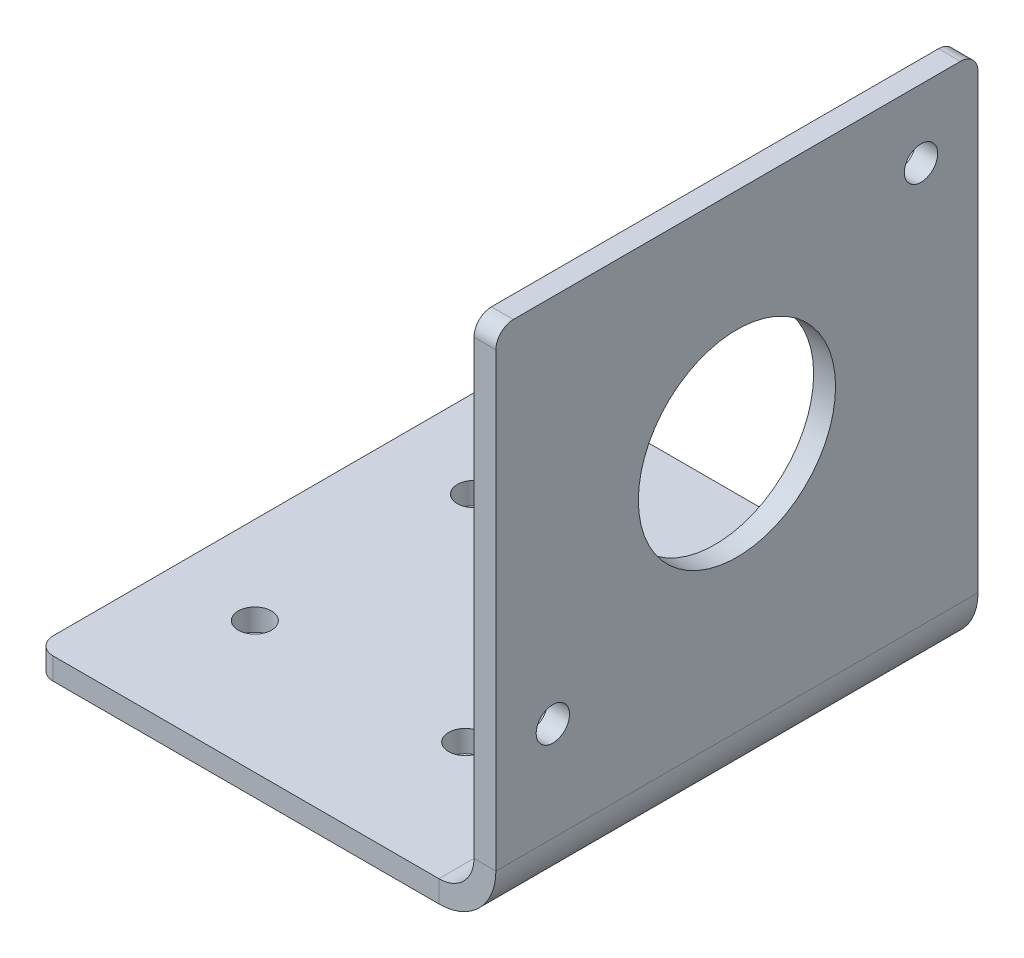
ISO-10303-21;
HEADER;
FILE_DESCRIPTION(('STEP AP214'),'2;1');
FILE_NAME('part.step','',(''),(''),'','','');
FILE_SCHEMA(('AUTOMOTIVE_DESIGN { 1 0 10303 214 1 1 1 1 }'));
ENDSEC;
DATA;
#1=APPLICATION_CONTEXT('core data for automotive mechanical design processes');
#2=APPLICATION_PROTOCOL_DEFINITION('international standard','automotive_design',2000,#1);
#3=PRODUCT_CONTEXT('',#1,'mechanical');
#4=PRODUCT('Part','Part','',(#3));
#5=PRODUCT_RELATED_PRODUCT_CATEGORY('part','',(#4));
#6=PRODUCT_DEFINITION_FORMATION('','',#4);
#7=PRODUCT_DEFINITION_CONTEXT('part definition',#1,'design');
#8=PRODUCT_DEFINITION('design','',#6,#7);
#9=PRODUCT_DEFINITION_SHAPE('','',#8);
#10=(LENGTH_UNIT() NAMED_UNIT(*) SI_UNIT(.MILLI.,.METRE.));
#11=(NAMED_UNIT(*) PLANE_ANGLE_UNIT() SI_UNIT($,.RADIAN.));
#12=(NAMED_UNIT(*) SI_UNIT($,.STERADIAN.) SOLID_ANGLE_UNIT());
#13=UNCERTAINTY_MEASURE_WITH_UNIT(LENGTH_MEASURE(1.E-05),#10,'distance_accuracy_value','');
#14=(GEOMETRIC_REPRESENTATION_CONTEXT(3) GLOBAL_UNCERTAINTY_ASSIGNED_CONTEXT((#13)) GLOBAL_UNIT_ASSIGNED_CONTEXT((#10,
#11,#12)) REPRESENTATION_CONTEXT('',''));
#15=CARTESIAN_POINT('',(0.,0.,0.));
#16=DIRECTION('',(0.,0.,1.));
#17=DIRECTION('',(1.,0.,0.));
#18=AXIS2_PLACEMENT_3D('',#15,#16,#17);
#19=CARTESIAN_POINT('',(-63.5,-34.925,-34.925));
#20=DIRECTION('',(0.,0.,-1.));
#21=DIRECTION('',(1.,0.,0.));
#22=AXIS2_PLACEMENT_3D('',#19,#20,#21);
#23=PLANE('',#22);
#24=DIRECTION('',(1.,0.,0.));
#25=VECTOR('',#24,1.);
#26=CARTESIAN_POINT('',(-63.5,-38.1,-34.925));
#27=LINE('',#26,#25);
#28=CARTESIAN_POINT('',(-60.96,-38.1,-34.925));
#29=VERTEX_POINT('',#28);
#30=CARTESIAN_POINT('',(-5.08,-38.1,-34.925));
#31=VERTEX_POINT('',#30);
#32=EDGE_CURVE('E192',#29,#31,#27,.T.);
#33=ORIENTED_EDGE('',*,*,#32,.F.);
#34=DIRECTION('',(0.,1.,0.));
#35=VECTOR('',#34,1.);
#36=CARTESIAN_POINT('',(-60.96,-34.925,-34.925));
#37=LINE('',#36,#35);
#38=CARTESIAN_POINT('',(-60.96,-34.925,-34.925));
#39=VERTEX_POINT('',#38);
#40=EDGE_CURVE('E135',#29,#39,#37,.T.);
#41=ORIENTED_EDGE('',*,*,#40,.T.);
#42=DIRECTION('',(1.,0.,0.));
#43=VECTOR('',#42,1.);
#44=CARTESIAN_POINT('',(-63.5,-34.925,-34.925));
#45=LINE('',#44,#43);
#46=CARTESIAN_POINT('',(-5.08,-34.925,-34.925));
#47=VERTEX_POINT('',#46);
#48=EDGE_CURVE('E129',#39,#47,#45,.T.);
#49=ORIENTED_EDGE('',*,*,#48,.T.);
#50=DIRECTION('',(0.,1.,0.));
#51=VECTOR('',#50,1.);
#52=CARTESIAN_POINT('',(-5.08,-34.925,-34.925));
#53=LINE('',#52,#51);
#54=EDGE_CURVE('E132',#31,#47,#53,.T.);
#55=ORIENTED_EDGE('',*,*,#54,.F.);
#56=EDGE_LOOP('',(#33,#41,#49,#55));
#57=FACE_BOUND('',#56,.T.);
#58=ADVANCED_FACE('F36',(#57),#23,.T.);
#59=CARTESIAN_POINT('',(-63.5,-34.925,-34.925));
#60=DIRECTION('',(-1.,0.,0.));
#61=DIRECTION('',(0.,0.,-1.));
#62=AXIS2_PLACEMENT_3D('',#59,#60,#61);
#63=PLANE('',#62);
#64=DIRECTION('',(0.,0.,-1.));
#65=VECTOR('',#64,1.);
#66=CARTESIAN_POINT('',(-63.5,-34.925,-34.925));
#67=LINE('',#66,#65);
#68=CARTESIAN_POINT('',(-63.5,-34.925,32.385));
#69=VERTEX_POINT('',#68);
#70=CARTESIAN_POINT('',(-63.5,-34.925,-32.385));
#71=VERTEX_POINT('',#70);
#72=EDGE_CURVE('E138',#69,#71,#67,.T.);
#73=ORIENTED_EDGE('',*,*,#72,.T.);
#74=DIRECTION('',(0.,1.,0.));
#75=VECTOR('',#74,1.);
#76=CARTESIAN_POINT('',(-63.5,-34.925,-32.385));
#77=LINE('',#76,#75);
#78=CARTESIAN_POINT('',(-63.5,-38.1,-32.385));
#79=VERTEX_POINT('',#78);
#80=EDGE_CURVE('E220',#71,#79,#77,.F.);
#81=ORIENTED_EDGE('',*,*,#80,.T.);
#82=DIRECTION('',(0.,0.,-1.));
#83=VECTOR('',#82,1.);
#84=CARTESIAN_POINT('',(-63.5,-38.1,-34.925));
#85=LINE('',#84,#83);
#86=CARTESIAN_POINT('',(-63.5,-38.1,32.385));
#87=VERTEX_POINT('',#86);
#88=EDGE_CURVE('E194',#87,#79,#85,.T.);
#89=ORIENTED_EDGE('',*,*,#88,.F.);
#90=DIRECTION('',(0.,-1.,0.));
#91=VECTOR('',#90,1.);
#92=CARTESIAN_POINT('',(-63.5,-34.925,32.385));
#93=LINE('',#92,#91);
#94=EDGE_CURVE('E217',#87,#69,#93,.F.);
#95=ORIENTED_EDGE('',*,*,#94,.T.);
#96=EDGE_LOOP('',(#73,#81,#89,#95));
#97=FACE_BOUND('',#96,.T.);
#98=ADVANCED_FACE('F293',(#97),#63,.T.);
#99=CARTESIAN_POINT('',(-63.5,-34.925,34.925));
#100=DIRECTION('',(0.,0.,-1.));
#101=DIRECTION('',(1.,0.,0.));
#102=AXIS2_PLACEMENT_3D('',#99,#100,#101);
#103=PLANE('',#102);
#104=DIRECTION('',(1.,0.,0.));
#105=VECTOR('',#104,1.);
#106=CARTESIAN_POINT('',(-63.5,-34.925,34.925));
#107=LINE('',#106,#105);
#108=CARTESIAN_POINT('',(-60.96,-34.925,34.925));
#109=VERTEX_POINT('',#108);
#110=CARTESIAN_POINT('',(-5.08,-34.925,34.925));
#111=VERTEX_POINT('',#110);
#112=EDGE_CURVE('E164',#109,#111,#107,.T.);
#113=ORIENTED_EDGE('',*,*,#112,.F.);
#114=DIRECTION('',(0.,1.,0.));
#115=VECTOR('',#114,1.);
#116=CARTESIAN_POINT('',(-60.96,-34.925,34.925));
#117=LINE('',#116,#115);
#118=CARTESIAN_POINT('',(-60.96,-38.1,34.925));
#119=VERTEX_POINT('',#118);
#120=EDGE_CURVE('E226',#109,#119,#117,.F.);
#121=ORIENTED_EDGE('',*,*,#120,.T.);
#122=DIRECTION('',(1.,0.,0.));
#123=VECTOR('',#122,1.);
#124=CARTESIAN_POINT('',(-63.5,-38.1,34.925));
#125=LINE('',#124,#123);
#126=CARTESIAN_POINT('',(-5.08,-38.1,34.925));
#127=VERTEX_POINT('',#126);
#128=EDGE_CURVE('E188',#119,#127,#125,.T.);
#129=ORIENTED_EDGE('',*,*,#128,.T.);
#130=DIRECTION('',(0.,1.,0.));
#131=VECTOR('',#130,1.);
#132=CARTESIAN_POINT('',(-5.08,-34.925,34.925));
#133=LINE('',#132,#131);
#134=EDGE_CURVE('E150',#127,#111,#133,.T.);
#135=ORIENTED_EDGE('',*,*,#134,.T.);
#136=EDGE_LOOP('',(#113,#121,#129,#135));
#137=FACE_BOUND('',#136,.T.);
#138=ADVANCED_FACE('F298',(#137),#103,.F.);
#139=CARTESIAN_POINT('',(-5.08,-29.845,34.925));
#140=DIRECTION('',(0.,0.,-1.));
#141=DIRECTION('',(-1.,0.,0.));
#142=AXIS2_PLACEMENT_3D('',#139,#140,#141);
#143=PLANE('',#142);
#144=ORIENTED_EDGE('',*,*,#134,.F.);
#145=CARTESIAN_POINT('',(-5.08,-29.845,34.925));
#146=DIRECTION('',(0.,0.,-1.));
#147=DIRECTION('',(-1.,0.,0.));
#148=AXIS2_PLACEMENT_3D('',#145,#146,#147);
#149=CIRCLE('',#148,8.255);
#150=CARTESIAN_POINT('',(3.175,-29.845,34.925));
#151=VERTEX_POINT('',#150);
#152=EDGE_CURVE('E189',#127,#151,#149,.F.);
#153=ORIENTED_EDGE('',*,*,#152,.T.);
#154=DIRECTION('',(-1.,0.,0.));
#155=VECTOR('',#154,1.);
#156=CARTESIAN_POINT('',(0.,-29.845,34.925));
#157=LINE('',#156,#155);
#158=CARTESIAN_POINT('',(0.,-29.845,34.925));
#159=VERTEX_POINT('',#158);
#160=EDGE_CURVE('E207',#151,#159,#157,.T.);
#161=ORIENTED_EDGE('',*,*,#160,.T.);
#162=CARTESIAN_POINT('',(-5.08,-29.845,34.925));
#163=DIRECTION('',(0.,0.,1.));
#164=DIRECTION('',(1.,0.,0.));
#165=AXIS2_PLACEMENT_3D('',#162,#163,#164);
#166=CIRCLE('',#165,5.08);
#167=EDGE_CURVE('E139',#111,#159,#166,.T.);
#168=ORIENTED_EDGE('',*,*,#167,.F.);
#169=EDGE_LOOP('',(#144,#153,#161,#168));
#170=FACE_BOUND('',#169,.T.);
#171=ADVANCED_FACE('F375',(#170),#143,.F.);
#172=CARTESIAN_POINT('',(0.,-38.1,34.925));
#173=DIRECTION('',(0.,0.,-1.));
#174=DIRECTION('',(0.,-1.,0.));
#175=AXIS2_PLACEMENT_3D('',#172,#173,#174);
#176=PLANE('',#175);
#177=DIRECTION('',(0.,1.,0.));
#178=VECTOR('',#177,1.);
#179=CARTESIAN_POINT('',(3.175,0.,34.925));
#180=LINE('',#179,#178);
#181=CARTESIAN_POINT('',(3.175,35.56,34.925));
#182=VERTEX_POINT('',#181);
#183=EDGE_CURVE('E186',#182,#151,#180,.F.);
#184=ORIENTED_EDGE('',*,*,#183,.F.);
#185=DIRECTION('',(1.,0.,0.));
#186=VECTOR('',#185,1.);
#187=CARTESIAN_POINT('',(0.,35.56,34.925));
#188=LINE('',#187,#186);
#189=CARTESIAN_POINT('',(0.,35.56,34.925));
#190=VERTEX_POINT('',#189);
#191=EDGE_CURVE('E11',#182,#190,#188,.F.);
#192=ORIENTED_EDGE('',*,*,#191,.T.);
#193=DIRECTION('',(0.,-1.,0.));
#194=VECTOR('',#193,1.);
#195=CARTESIAN_POINT('',(0.,-38.1,34.925));
#196=LINE('',#195,#194);
#197=EDGE_CURVE('E261',#190,#159,#196,.T.);
#198=ORIENTED_EDGE('',*,*,#197,.T.);
#199=ORIENTED_EDGE('',*,*,#160,.F.);
#200=EDGE_LOOP('',(#184,#192,#198,#199));
#201=FACE_BOUND('',#200,.T.);
#202=ADVANCED_FACE('F383',(#201),#176,.F.);
#203=CARTESIAN_POINT('',(0.,38.1,34.925));
#204=DIRECTION('',(0.,-1.,0.));
#205=DIRECTION('',(0.,0.,1.));
#206=AXIS2_PLACEMENT_3D('',#203,#204,#205);
#207=PLANE('',#206);
#208=DIRECTION('',(0.,0.,1.));
#209=VECTOR('',#208,1.);
#210=CARTESIAN_POINT('',(3.175,38.1,0.));
#211=LINE('',#210,#209);
#212=CARTESIAN_POINT('',(3.175,38.1,-32.385));
#213=VERTEX_POINT('',#212);
#214=CARTESIAN_POINT('',(3.175,38.1,32.385));
#215=VERTEX_POINT('',#214);
#216=EDGE_CURVE('E184',#213,#215,#211,.T.);
#217=ORIENTED_EDGE('',*,*,#216,.F.);
#218=DIRECTION('',(1.,0.,0.));
#219=VECTOR('',#218,1.);
#220=CARTESIAN_POINT('',(0.,38.1,-32.385));
#221=LINE('',#220,#219);
#222=CARTESIAN_POINT('',(0.,38.1,-32.385));
#223=VERTEX_POINT('',#222);
#224=EDGE_CURVE('E230',#213,#223,#221,.F.);
#225=ORIENTED_EDGE('',*,*,#224,.T.);
#226=DIRECTION('',(0.,0.,1.));
#227=VECTOR('',#226,1.);
#228=CARTESIAN_POINT('',(0.,38.1,34.925));
#229=LINE('',#228,#227);
#230=CARTESIAN_POINT('',(0.,38.1,32.385));
#231=VERTEX_POINT('',#230);
#232=EDGE_CURVE('E255',#223,#231,#229,.T.);
#233=ORIENTED_EDGE('',*,*,#232,.T.);
#234=DIRECTION('',(1.,0.,0.));
#235=VECTOR('',#234,1.);
#236=CARTESIAN_POINT('',(0.,38.1,32.385));
#237=LINE('',#236,#235);
#238=EDGE_CURVE('E228',#231,#215,#237,.T.);
#239=ORIENTED_EDGE('',*,*,#238,.T.);
#240=EDGE_LOOP('',(#217,#225,#233,#239));
#241=FACE_BOUND('',#240,.T.);
#242=ADVANCED_FACE('F246',(#241),#207,.F.);
#243=CARTESIAN_POINT('',(0.,-38.1,-34.925));
#244=DIRECTION('',(0.,0.,1.));
#245=DIRECTION('',(0.,1.,0.));
#246=AXIS2_PLACEMENT_3D('',#243,#244,#245);
#247=PLANE('',#246);
#248=DIRECTION('',(0.,1.,0.));
#249=VECTOR('',#248,1.);
#250=CARTESIAN_POINT('',(0.,-38.1,-34.925));
#251=LINE('',#250,#249);
#252=CARTESIAN_POINT('',(0.,-29.845,-34.925));
#253=VERTEX_POINT('',#252);
#254=CARTESIAN_POINT('',(0.,35.56,-34.925));
#255=VERTEX_POINT('',#254);
#256=EDGE_CURVE('E254',#253,#255,#251,.T.);
#257=ORIENTED_EDGE('',*,*,#256,.T.);
#258=DIRECTION('',(1.,0.,0.));
#259=VECTOR('',#258,1.);
#260=CARTESIAN_POINT('',(0.,35.56,-34.925));
#261=LINE('',#260,#259);
#262=CARTESIAN_POINT('',(3.175,35.56,-34.925));
#263=VERTEX_POINT('',#262);
#264=EDGE_CURVE('E59',#255,#263,#261,.T.);
#265=ORIENTED_EDGE('',*,*,#264,.T.);
#266=DIRECTION('',(0.,1.,0.));
#267=VECTOR('',#266,1.);
#268=CARTESIAN_POINT('',(3.175,0.,-34.925));
#269=LINE('',#268,#267);
#270=CARTESIAN_POINT('',(3.175,-29.845,-34.925));
#271=VERTEX_POINT('',#270);
#272=EDGE_CURVE('E181',#271,#263,#269,.T.);
#273=ORIENTED_EDGE('',*,*,#272,.F.);
#274=DIRECTION('',(-1.,0.,0.));
#275=VECTOR('',#274,1.);
#276=CARTESIAN_POINT('',(0.,-29.845,-34.925));
#277=LINE('',#276,#275);
#278=EDGE_CURVE('E168',#271,#253,#277,.T.);
#279=ORIENTED_EDGE('',*,*,#278,.T.);
#280=EDGE_LOOP('',(#257,#265,#273,#279));
#281=FACE_BOUND('',#280,.T.);
#282=ADVANCED_FACE('F256',(#281),#247,.F.);
#283=CARTESIAN_POINT('',(-5.08,-29.845,-34.925));
#284=DIRECTION('',(0.,0.,-1.));
#285=DIRECTION('',(-1.,0.,0.));
#286=AXIS2_PLACEMENT_3D('',#283,#284,#285);
#287=PLANE('',#286);
#288=CARTESIAN_POINT('',(-5.08,-29.845,-34.925));
#289=DIRECTION('',(0.,0.,-1.));
#290=DIRECTION('',(-1.,0.,0.));
#291=AXIS2_PLACEMENT_3D('',#288,#289,#290);
#292=CIRCLE('',#291,8.255);
#293=EDGE_CURVE('E149',#271,#31,#292,.T.);
#294=ORIENTED_EDGE('',*,*,#293,.T.);
#295=ORIENTED_EDGE('',*,*,#54,.T.);
#296=CARTESIAN_POINT('',(-5.08,-29.845,-34.925));
#297=DIRECTION('',(0.,0.,1.));
#298=DIRECTION('',(1.,0.,0.));
#299=AXIS2_PLACEMENT_3D('',#296,#297,#298);
#300=CIRCLE('',#299,5.08);
#301=EDGE_CURVE('E146',#253,#47,#300,.F.);
#302=ORIENTED_EDGE('',*,*,#301,.F.);
#303=ORIENTED_EDGE('',*,*,#278,.F.);
#304=EDGE_LOOP('',(#294,#295,#302,#303));
#305=FACE_BOUND('',#304,.T.);
#306=ADVANCED_FACE('F145',(#305),#287,.T.);
#307=CARTESIAN_POINT('',(0.,28.194,-26.67));
#308=DIRECTION('',(-1.,0.,0.));
#309=DIRECTION('',(0.,0.,1.));
#310=AXIS2_PLACEMENT_3D('',#307,#308,#309);
#311=CYLINDRICAL_SURFACE('',#310,2.413);
#312=CARTESIAN_POINT('',(0.,28.194,-26.67));
#313=DIRECTION('',(1.,0.,0.));
#314=DIRECTION('',(0.,0.,-1.));
#315=AXIS2_PLACEMENT_3D('',#312,#313,#314);
#316=CIRCLE('',#315,2.413);
#317=CARTESIAN_POINT('',(0.,28.194,-29.083));
#318=VERTEX_POINT('',#317);
#319=EDGE_CURVE('E257',#318,#318,#316,.T.);
#320=ORIENTED_EDGE('',*,*,#319,.F.);
#321=EDGE_LOOP('',(#320));
#322=FACE_BOUND('',#321,.T.);
#323=CARTESIAN_POINT('',(3.175,28.194,-26.67));
#324=DIRECTION('',(1.,0.,0.));
#325=DIRECTION('',(0.,0.,-1.));
#326=AXIS2_PLACEMENT_3D('',#323,#324,#325);
#327=CIRCLE('',#326,2.413);
#328=CARTESIAN_POINT('',(3.175,28.194,-29.083));
#329=VERTEX_POINT('',#328);
#330=EDGE_CURVE('E183',#329,#329,#327,.T.);
#331=ORIENTED_EDGE('',*,*,#330,.T.);
#332=EDGE_LOOP('',(#331));
#333=FACE_BOUND('',#332,.T.);
#334=ADVANCED_FACE('F273',(#322,#333),#311,.F.);
#335=CARTESIAN_POINT('',(0.,6.35,0.));
#336=DIRECTION('',(-1.,0.,0.));
#337=DIRECTION('',(0.,0.,1.));
#338=AXIS2_PLACEMENT_3D('',#335,#336,#337);
#339=CYLINDRICAL_SURFACE('',#338,14.2875);
#340=CARTESIAN_POINT('',(0.,6.35,0.));
#341=DIRECTION('',(1.,0.,0.));
#342=DIRECTION('',(0.,0.,-1.));
#343=AXIS2_PLACEMENT_3D('',#340,#341,#342);
#344=CIRCLE('',#343,14.2875);
#345=CARTESIAN_POINT('',(0.,6.35,-14.2875));
#346=VERTEX_POINT('',#345);
#347=EDGE_CURVE('E171',#346,#346,#344,.T.);
#348=ORIENTED_EDGE('',*,*,#347,.F.);
#349=EDGE_LOOP('',(#348));
#350=FACE_BOUND('',#349,.T.);
#351=CARTESIAN_POINT('',(3.175,6.35,0.));
#352=DIRECTION('',(1.,0.,0.));
#353=DIRECTION('',(0.,0.,-1.));
#354=AXIS2_PLACEMENT_3D('',#351,#352,#353);
#355=CIRCLE('',#354,14.2875);
#356=CARTESIAN_POINT('',(3.175,6.35,-14.2875));
#357=VERTEX_POINT('',#356);
#358=EDGE_CURVE('E202',#357,#357,#355,.T.);
#359=ORIENTED_EDGE('',*,*,#358,.T.);
#360=EDGE_LOOP('',(#359));
#361=FACE_BOUND('',#360,.T.);
#362=ADVANCED_FACE('F269',(#350,#361),#339,.F.);
#363=CARTESIAN_POINT('',(0.,-15.494,26.67));
#364=DIRECTION('',(-1.,0.,0.));
#365=DIRECTION('',(0.,0.,1.));
#366=AXIS2_PLACEMENT_3D('',#363,#364,#365);
#367=CYLINDRICAL_SURFACE('',#366,2.413);
#368=CARTESIAN_POINT('',(0.,-15.494,26.67));
#369=DIRECTION('',(1.,0.,0.));
#370=DIRECTION('',(0.,0.,-1.));
#371=AXIS2_PLACEMENT_3D('',#368,#369,#370);
#372=CIRCLE('',#371,2.413);
#373=CARTESIAN_POINT('',(0.,-15.494,24.257));
#374=VERTEX_POINT('',#373);
#375=EDGE_CURVE('E166',#374,#374,#372,.T.);
#376=ORIENTED_EDGE('',*,*,#375,.F.);
#377=EDGE_LOOP('',(#376));
#378=FACE_BOUND('',#377,.T.);
#379=CARTESIAN_POINT('',(3.175,-15.494,26.67));
#380=DIRECTION('',(1.,0.,0.));
#381=DIRECTION('',(0.,0.,-1.));
#382=AXIS2_PLACEMENT_3D('',#379,#380,#381);
#383=CIRCLE('',#382,2.413);
#384=CARTESIAN_POINT('',(3.175,-15.494,24.257));
#385=VERTEX_POINT('',#384);
#386=EDGE_CURVE('E180',#385,#385,#383,.T.);
#387=ORIENTED_EDGE('',*,*,#386,.T.);
#388=EDGE_LOOP('',(#387));
#389=FACE_BOUND('',#388,.T.);
#390=ADVANCED_FACE('F272',(#378,#389),#367,.F.);
#391=CARTESIAN_POINT('',(0.,0.,0.));
#392=DIRECTION('',(-1.,0.,0.));
#393=DIRECTION('',(0.,0.,1.));
#394=AXIS2_PLACEMENT_3D('',#391,#392,#393);
#395=PLANE('',#394);
#396=ORIENTED_EDGE('',*,*,#232,.F.);
#397=CARTESIAN_POINT('',(0.,35.56,-32.385));
#398=DIRECTION('',(-1.,0.,0.));
#399=DIRECTION('',(0.,0.,1.));
#400=AXIS2_PLACEMENT_3D('',#397,#398,#399);
#401=CIRCLE('',#400,2.54);
#402=EDGE_CURVE('E235',#223,#255,#401,.T.);
#403=ORIENTED_EDGE('',*,*,#402,.T.);
#404=ORIENTED_EDGE('',*,*,#256,.F.);
#405=DIRECTION('',(0.,0.,-1.));
#406=VECTOR('',#405,1.);
#407=CARTESIAN_POINT('',(0.,-29.845,0.));
#408=LINE('',#407,#406);
#409=EDGE_CURVE('E159',#253,#159,#408,.F.);
#410=ORIENTED_EDGE('',*,*,#409,.T.);
#411=ORIENTED_EDGE('',*,*,#197,.F.);
#412=CARTESIAN_POINT('',(0.,35.56,32.385));
#413=DIRECTION('',(-1.,0.,0.));
#414=DIRECTION('',(0.,0.,1.));
#415=AXIS2_PLACEMENT_3D('',#412,#413,#414);
#416=CIRCLE('',#415,2.54);
#417=EDGE_CURVE('E233',#190,#231,#416,.T.);
#418=ORIENTED_EDGE('',*,*,#417,.T.);
#419=EDGE_LOOP('',(#396,#403,#404,#410,#411,#418));
#420=FACE_BOUND('',#419,.T.);
#421=ORIENTED_EDGE('',*,*,#319,.T.);
#422=EDGE_LOOP('',(#421));
#423=FACE_BOUND('',#422,.T.);
#424=ORIENTED_EDGE('',*,*,#347,.T.);
#425=EDGE_LOOP('',(#424));
#426=FACE_BOUND('',#425,.T.);
#427=ORIENTED_EDGE('',*,*,#375,.T.);
#428=EDGE_LOOP('',(#427));
#429=FACE_BOUND('',#428,.T.);
#430=ADVANCED_FACE('F252',(#420,#423,#426,#429),#395,.T.);
#431=CARTESIAN_POINT('',(-63.5,-34.925,-34.925));
#432=DIRECTION('',(0.,-1.,0.));
#433=DIRECTION('',(0.,0.,-1.));
#434=AXIS2_PLACEMENT_3D('',#431,#432,#433);
#435=PLANE('',#434);
#436=CARTESIAN_POINT('',(-20.32,-34.925,-15.875));
#437=DIRECTION('',(0.,1.,0.));
#438=DIRECTION('',(0.,0.,1.));
#439=AXIS2_PLACEMENT_3D('',#436,#437,#438);
#440=CIRCLE('',#439,2.413);
#441=CARTESIAN_POINT('',(-20.32,-34.925,-13.462));
#442=VERTEX_POINT('',#441);
#443=EDGE_CURVE('E602',#442,#442,#440,.T.);
#444=ORIENTED_EDGE('',*,*,#443,.F.);
#445=EDGE_LOOP('',(#444));
#446=FACE_BOUND('',#445,.T.);
#447=CARTESIAN_POINT('',(-50.8,-34.925,15.875));
#448=DIRECTION('',(0.,1.,0.));
#449=DIRECTION('',(0.,0.,1.));
#450=AXIS2_PLACEMENT_3D('',#447,#448,#449);
#451=CIRCLE('',#450,2.41299999999999);
#452=CARTESIAN_POINT('',(-50.8,-34.925,18.288));
#453=VERTEX_POINT('',#452);
#454=EDGE_CURVE('E595',#453,#453,#451,.T.);
#455=ORIENTED_EDGE('',*,*,#454,.F.);
#456=EDGE_LOOP('',(#455));
#457=FACE_BOUND('',#456,.T.);
#458=CARTESIAN_POINT('',(-20.32,-34.925,15.875));
#459=DIRECTION('',(0.,1.,0.));
#460=DIRECTION('',(0.,0.,1.));
#461=AXIS2_PLACEMENT_3D('',#458,#459,#460);
#462=CIRCLE('',#461,2.413);
#463=CARTESIAN_POINT('',(-20.32,-34.925,18.288));
#464=VERTEX_POINT('',#463);
#465=EDGE_CURVE('E607',#464,#464,#462,.T.);
#466=ORIENTED_EDGE('',*,*,#465,.F.);
#467=EDGE_LOOP('',(#466));
#468=FACE_BOUND('',#467,.T.);
#469=CARTESIAN_POINT('',(-50.8,-34.925,-15.875));
#470=DIRECTION('',(0.,1.,0.));
#471=DIRECTION('',(0.,0.,1.));
#472=AXIS2_PLACEMENT_3D('',#469,#470,#471);
#473=CIRCLE('',#472,2.413);
#474=CARTESIAN_POINT('',(-50.8,-34.925,-13.462));
#475=VERTEX_POINT('',#474);
#476=EDGE_CURVE('E589',#475,#475,#473,.T.);
#477=ORIENTED_EDGE('',*,*,#476,.F.);
#478=EDGE_LOOP('',(#477));
#479=FACE_BOUND('',#478,.T.);
#480=ORIENTED_EDGE('',*,*,#48,.F.);
#481=CARTESIAN_POINT('',(-60.96,-34.925,-32.385));
#482=DIRECTION('',(0.,-1.,0.));
#483=DIRECTION('',(0.,0.,-1.));
#484=AXIS2_PLACEMENT_3D('',#481,#482,#483);
#485=CIRCLE('',#484,2.54);
#486=EDGE_CURVE('E215',#39,#71,#485,.F.);
#487=ORIENTED_EDGE('',*,*,#486,.T.);
#488=ORIENTED_EDGE('',*,*,#72,.F.);
#489=CARTESIAN_POINT('',(-60.96,-34.925,32.385));
#490=DIRECTION('',(0.,-1.,0.));
#491=DIRECTION('',(0.,0.,-1.));
#492=AXIS2_PLACEMENT_3D('',#489,#490,#491);
#493=CIRCLE('',#492,2.54);
#494=EDGE_CURVE('E213',#69,#109,#493,.F.);
#495=ORIENTED_EDGE('',*,*,#494,.T.);
#496=ORIENTED_EDGE('',*,*,#112,.T.);
#497=DIRECTION('',(0.,0.,-1.));
#498=VECTOR('',#497,1.);
#499=CARTESIAN_POINT('',(-5.08,-34.925,-34.925));
#500=LINE('',#499,#498);
#501=EDGE_CURVE('E157',#111,#47,#500,.T.);
#502=ORIENTED_EDGE('',*,*,#501,.T.);
#503=EDGE_LOOP('',(#480,#487,#488,#495,#496,#502));
#504=FACE_BOUND('',#503,.T.);
#505=ADVANCED_FACE('F162',(#446,#457,#468,#479,#504),#435,.F.);
#506=CARTESIAN_POINT('',(-5.08,-29.845,-34.925));
#507=DIRECTION('',(0.,0.,-1.));
#508=DIRECTION('',(-1.,0.,0.));
#509=AXIS2_PLACEMENT_3D('',#506,#507,#508);
#510=CYLINDRICAL_SURFACE('',#509,5.08);
#511=ORIENTED_EDGE('',*,*,#167,.T.);
#512=ORIENTED_EDGE('',*,*,#409,.F.);
#513=ORIENTED_EDGE('',*,*,#301,.T.);
#514=ORIENTED_EDGE('',*,*,#501,.F.);
#515=EDGE_LOOP('',(#511,#512,#513,#514));
#516=FACE_BOUND('',#515,.T.);
#517=ADVANCED_FACE('F156',(#516),#510,.F.);
#518=CARTESIAN_POINT('',(3.175,0.,0.));
#519=DIRECTION('',(-1.,0.,0.));
#520=DIRECTION('',(0.,0.,1.));
#521=AXIS2_PLACEMENT_3D('',#518,#519,#520);
#522=PLANE('',#521);
#523=ORIENTED_EDGE('',*,*,#272,.T.);
#524=CARTESIAN_POINT('',(3.175,35.56,-32.385));
#525=DIRECTION('',(-1.,0.,0.));
#526=DIRECTION('',(0.,0.,1.));
#527=AXIS2_PLACEMENT_3D('',#524,#525,#526);
#528=CIRCLE('',#527,2.54);
#529=EDGE_CURVE('E44',#263,#213,#528,.F.);
#530=ORIENTED_EDGE('',*,*,#529,.T.);
#531=ORIENTED_EDGE('',*,*,#216,.T.);
#532=CARTESIAN_POINT('',(3.175,35.56,32.385));
#533=DIRECTION('',(-1.,0.,0.));
#534=DIRECTION('',(0.,0.,1.));
#535=AXIS2_PLACEMENT_3D('',#532,#533,#534);
#536=CIRCLE('',#535,2.54);
#537=EDGE_CURVE('E51',#215,#182,#536,.F.);
#538=ORIENTED_EDGE('',*,*,#537,.T.);
#539=ORIENTED_EDGE('',*,*,#183,.T.);
#540=DIRECTION('',(0.,0.,1.));
#541=VECTOR('',#540,1.);
#542=CARTESIAN_POINT('',(3.175,-29.845,0.));
#543=LINE('',#542,#541);
#544=EDGE_CURVE('E160',#271,#151,#543,.T.);
#545=ORIENTED_EDGE('',*,*,#544,.F.);
#546=EDGE_LOOP('',(#523,#530,#531,#538,#539,#545));
#547=FACE_BOUND('',#546,.T.);
#548=ORIENTED_EDGE('',*,*,#330,.F.);
#549=EDGE_LOOP('',(#548));
#550=FACE_BOUND('',#549,.T.);
#551=ORIENTED_EDGE('',*,*,#358,.F.);
#552=EDGE_LOOP('',(#551));
#553=FACE_BOUND('',#552,.T.);
#554=ORIENTED_EDGE('',*,*,#386,.F.);
#555=EDGE_LOOP('',(#554));
#556=FACE_BOUND('',#555,.T.);
#557=ADVANCED_FACE('F240',(#547,#550,#553,#556),#522,.F.);
#558=CARTESIAN_POINT('',(-63.5,-38.1,-34.925));
#559=DIRECTION('',(0.,-1.,0.));
#560=DIRECTION('',(0.,0.,-1.));
#561=AXIS2_PLACEMENT_3D('',#558,#559,#560);
#562=PLANE('',#561);
#563=CARTESIAN_POINT('',(-20.32,-38.1,-15.875));
#564=DIRECTION('',(0.,1.,0.));
#565=DIRECTION('',(0.,0.,1.));
#566=AXIS2_PLACEMENT_3D('',#563,#564,#565);
#567=CIRCLE('',#566,2.413);
#568=CARTESIAN_POINT('',(-20.32,-38.1,-13.462));
#569=VERTEX_POINT('',#568);
#570=EDGE_CURVE('E592',#569,#569,#567,.T.);
#571=ORIENTED_EDGE('',*,*,#570,.T.);
#572=EDGE_LOOP('',(#571));
#573=FACE_BOUND('',#572,.T.);
#574=CARTESIAN_POINT('',(-50.8,-38.1,15.875));
#575=DIRECTION('',(0.,1.,0.));
#576=DIRECTION('',(0.,0.,1.));
#577=AXIS2_PLACEMENT_3D('',#574,#575,#576);
#578=CIRCLE('',#577,2.41299999999999);
#579=CARTESIAN_POINT('',(-50.8,-38.1,18.288));
#580=VERTEX_POINT('',#579);
#581=EDGE_CURVE('E598',#580,#580,#578,.T.);
#582=ORIENTED_EDGE('',*,*,#581,.T.);
#583=EDGE_LOOP('',(#582));
#584=FACE_BOUND('',#583,.T.);
#585=CARTESIAN_POINT('',(-20.32,-38.1,15.875));
#586=DIRECTION('',(0.,1.,0.));
#587=DIRECTION('',(0.,0.,1.));
#588=AXIS2_PLACEMENT_3D('',#585,#586,#587);
#589=CIRCLE('',#588,2.413);
#590=CARTESIAN_POINT('',(-20.32,-38.1,18.288));
#591=VERTEX_POINT('',#590);
#592=EDGE_CURVE('E599',#591,#591,#589,.T.);
#593=ORIENTED_EDGE('',*,*,#592,.T.);
#594=EDGE_LOOP('',(#593));
#595=FACE_BOUND('',#594,.T.);
#596=CARTESIAN_POINT('',(-50.8,-38.1,-15.875));
#597=DIRECTION('',(0.,1.,0.));
#598=DIRECTION('',(0.,0.,1.));
#599=AXIS2_PLACEMENT_3D('',#596,#597,#598);
#600=CIRCLE('',#599,2.413);
#601=CARTESIAN_POINT('',(-50.8,-38.1,-13.462));
#602=VERTEX_POINT('',#601);
#603=EDGE_CURVE('E199',#602,#602,#600,.T.);
#604=ORIENTED_EDGE('',*,*,#603,.T.);
#605=EDGE_LOOP('',(#604));
#606=FACE_BOUND('',#605,.T.);
#607=ORIENTED_EDGE('',*,*,#88,.T.);
#608=CARTESIAN_POINT('',(-60.96,-38.1,-32.385));
#609=DIRECTION('',(0.,-1.,0.));
#610=DIRECTION('',(0.,0.,-1.));
#611=AXIS2_PLACEMENT_3D('',#608,#609,#610);
#612=CIRCLE('',#611,2.54);
#613=EDGE_CURVE('E224',#79,#29,#612,.T.);
#614=ORIENTED_EDGE('',*,*,#613,.T.);
#615=ORIENTED_EDGE('',*,*,#32,.T.);
#616=DIRECTION('',(0.,0.,-1.));
#617=VECTOR('',#616,1.);
#618=CARTESIAN_POINT('',(-5.08,-38.1,-34.925));
#619=LINE('',#618,#617);
#620=EDGE_CURVE('E178',#127,#31,#619,.T.);
#621=ORIENTED_EDGE('',*,*,#620,.F.);
#622=ORIENTED_EDGE('',*,*,#128,.F.);
#623=CARTESIAN_POINT('',(-60.96,-38.1,32.385));
#624=DIRECTION('',(0.,-1.,0.));
#625=DIRECTION('',(0.,0.,-1.));
#626=AXIS2_PLACEMENT_3D('',#623,#624,#625);
#627=CIRCLE('',#626,2.54);
#628=EDGE_CURVE('E222',#119,#87,#627,.T.);
#629=ORIENTED_EDGE('',*,*,#628,.T.);
#630=EDGE_LOOP('',(#607,#614,#615,#621,#622,#629));
#631=FACE_BOUND('',#630,.T.);
#632=ADVANCED_FACE('F279',(#573,#584,#595,#606,#631),#562,.T.);
#633=CARTESIAN_POINT('',(-5.08,-29.845,-34.925));
#634=DIRECTION('',(0.,0.,-1.));
#635=DIRECTION('',(-1.,0.,0.));
#636=AXIS2_PLACEMENT_3D('',#633,#634,#635);
#637=CYLINDRICAL_SURFACE('',#636,8.255);
#638=ORIENTED_EDGE('',*,*,#152,.F.);
#639=ORIENTED_EDGE('',*,*,#620,.T.);
#640=ORIENTED_EDGE('',*,*,#293,.F.);
#641=ORIENTED_EDGE('',*,*,#544,.T.);
#642=EDGE_LOOP('',(#638,#639,#640,#641));
#643=FACE_BOUND('',#642,.T.);
#644=ADVANCED_FACE('F343',(#643),#637,.T.);
#645=CARTESIAN_POINT('',(-60.96,-34.925,-32.385));
#646=DIRECTION('',(0.,1.,0.));
#647=DIRECTION('',(0.,0.,1.));
#648=AXIS2_PLACEMENT_3D('',#645,#646,#647);
#649=CYLINDRICAL_SURFACE('',#648,2.54);
#650=ORIENTED_EDGE('',*,*,#613,.F.);
#651=ORIENTED_EDGE('',*,*,#80,.F.);
#652=ORIENTED_EDGE('',*,*,#486,.F.);
#653=ORIENTED_EDGE('',*,*,#40,.F.);
#654=EDGE_LOOP('',(#650,#651,#652,#653));
#655=FACE_BOUND('',#654,.T.);
#656=ADVANCED_FACE('F347',(#655),#649,.T.);
#657=CARTESIAN_POINT('',(-60.96,-34.925,32.385));
#658=DIRECTION('',(0.,-1.,0.));
#659=DIRECTION('',(0.,0.,-1.));
#660=AXIS2_PLACEMENT_3D('',#657,#658,#659);
#661=CYLINDRICAL_SURFACE('',#660,2.54);
#662=ORIENTED_EDGE('',*,*,#628,.F.);
#663=ORIENTED_EDGE('',*,*,#120,.F.);
#664=ORIENTED_EDGE('',*,*,#494,.F.);
#665=ORIENTED_EDGE('',*,*,#94,.F.);
#666=EDGE_LOOP('',(#662,#663,#664,#665));
#667=FACE_BOUND('',#666,.T.);
#668=ADVANCED_FACE('F426',(#667),#661,.T.);
#669=CARTESIAN_POINT('',(0.,35.56,-32.385));
#670=DIRECTION('',(-1.,0.,0.));
#671=DIRECTION('',(0.,0.,1.));
#672=AXIS2_PLACEMENT_3D('',#669,#670,#671);
#673=CYLINDRICAL_SURFACE('',#672,2.54);
#674=ORIENTED_EDGE('',*,*,#529,.F.);
#675=ORIENTED_EDGE('',*,*,#264,.F.);
#676=ORIENTED_EDGE('',*,*,#402,.F.);
#677=ORIENTED_EDGE('',*,*,#224,.F.);
#678=EDGE_LOOP('',(#674,#675,#676,#677));
#679=FACE_BOUND('',#678,.T.);
#680=ADVANCED_FACE('F250',(#679),#673,.T.);
#681=CARTESIAN_POINT('',(0.,35.56,32.385));
#682=DIRECTION('',(-1.,0.,0.));
#683=DIRECTION('',(0.,0.,1.));
#684=AXIS2_PLACEMENT_3D('',#681,#682,#683);
#685=CYLINDRICAL_SURFACE('',#684,2.54);
#686=ORIENTED_EDGE('',*,*,#537,.F.);
#687=ORIENTED_EDGE('',*,*,#238,.F.);
#688=ORIENTED_EDGE('',*,*,#417,.F.);
#689=ORIENTED_EDGE('',*,*,#191,.F.);
#690=EDGE_LOOP('',(#686,#687,#688,#689));
#691=FACE_BOUND('',#690,.T.);
#692=ADVANCED_FACE('F38',(#691),#685,.T.);
#693=CARTESIAN_POINT('',(-50.8,-38.1,-15.875));
#694=DIRECTION('',(0.,1.,0.));
#695=DIRECTION('',(0.,0.,1.));
#696=AXIS2_PLACEMENT_3D('',#693,#694,#695);
#697=CYLINDRICAL_SURFACE('',#696,2.413);
#698=ORIENTED_EDGE('',*,*,#603,.F.);
#699=EDGE_LOOP('',(#698));
#700=FACE_BOUND('',#699,.T.);
#701=ORIENTED_EDGE('',*,*,#476,.T.);
#702=EDGE_LOOP('',(#701));
#703=FACE_BOUND('',#702,.T.);
#704=ADVANCED_FACE('F451',(#700,#703),#697,.F.);
#705=CARTESIAN_POINT('',(-20.32,-38.1,15.875));
#706=DIRECTION('',(0.,1.,0.));
#707=DIRECTION('',(0.,0.,1.));
#708=AXIS2_PLACEMENT_3D('',#705,#706,#707);
#709=CYLINDRICAL_SURFACE('',#708,2.413);
#710=ORIENTED_EDGE('',*,*,#592,.F.);
#711=EDGE_LOOP('',(#710));
#712=FACE_BOUND('',#711,.T.);
#713=ORIENTED_EDGE('',*,*,#465,.T.);
#714=EDGE_LOOP('',(#713));
#715=FACE_BOUND('',#714,.T.);
#716=ADVANCED_FACE('F476',(#712,#715),#709,.F.);
#717=CARTESIAN_POINT('',(-50.8,-38.1,15.875));
#718=DIRECTION('',(0.,1.,0.));
#719=DIRECTION('',(0.,0.,1.));
#720=AXIS2_PLACEMENT_3D('',#717,#718,#719);
#721=CYLINDRICAL_SURFACE('',#720,2.41299999999999);
#722=ORIENTED_EDGE('',*,*,#581,.F.);
#723=EDGE_LOOP('',(#722));
#724=FACE_BOUND('',#723,.T.);
#725=ORIENTED_EDGE('',*,*,#454,.T.);
#726=EDGE_LOOP('',(#725));
#727=FACE_BOUND('',#726,.T.);
#728=ADVANCED_FACE('F487',(#724,#727),#721,.F.);
#729=CARTESIAN_POINT('',(-20.32,-38.1,-15.875));
#730=DIRECTION('',(0.,1.,0.));
#731=DIRECTION('',(0.,0.,1.));
#732=AXIS2_PLACEMENT_3D('',#729,#730,#731);
#733=CYLINDRICAL_SURFACE('',#732,2.413);
#734=ORIENTED_EDGE('',*,*,#570,.F.);
#735=EDGE_LOOP('',(#734));
#736=FACE_BOUND('',#735,.T.);
#737=ORIENTED_EDGE('',*,*,#443,.T.);
#738=EDGE_LOOP('',(#737));
#739=FACE_BOUND('',#738,.T.);
#740=ADVANCED_FACE('F498',(#736,#739),#733,.F.);
#741=CLOSED_SHELL('',(#58,#98,#138,#171,#202,#242,#282,#306,#334,#362,#390,#430,#505,#517,#557,
#632,#644,#656,#668,#680,#692,#704,#716,#728,#740));
#742=MANIFOLD_SOLID_BREP('B2',#741);
#743=ADVANCED_BREP_SHAPE_REPRESENTATION('',(#18,#742),#14);
#744=SHAPE_DEFINITION_REPRESENTATION(#9,#743);
ENDSEC;
END-ISO-10303-21;
